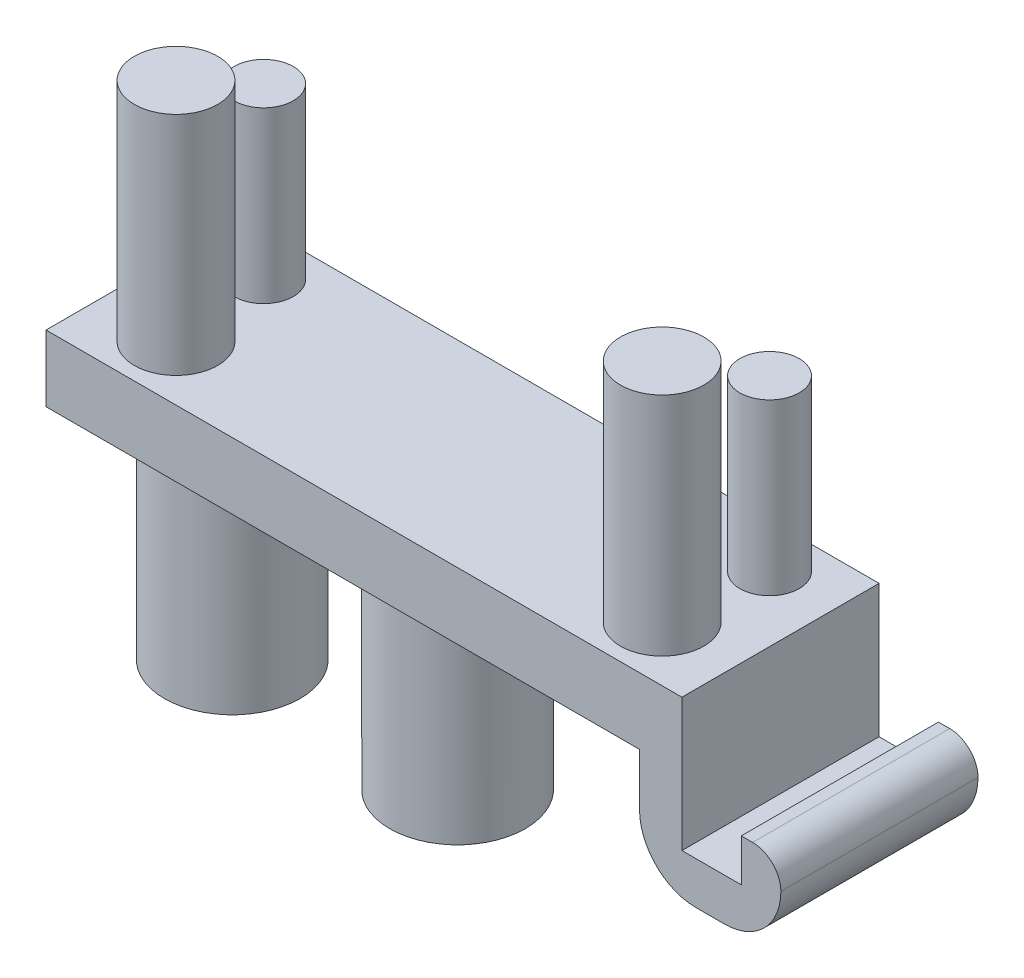
ISO-10303-21;
HEADER;
FILE_DESCRIPTION(('STEP AP214'),'2;1');
FILE_NAME('part.step','',(''),(''),'','','');
FILE_SCHEMA(('AUTOMOTIVE_DESIGN { 1 0 10303 214 1 1 1 1 }'));
ENDSEC;
DATA;
#1=APPLICATION_CONTEXT('core data for automotive mechanical design processes');
#2=APPLICATION_PROTOCOL_DEFINITION('international standard','automotive_design',2000,#1);
#3=PRODUCT_CONTEXT('',#1,'mechanical');
#4=PRODUCT('Part','Part','',(#3));
#5=PRODUCT_RELATED_PRODUCT_CATEGORY('part','',(#4));
#6=PRODUCT_DEFINITION_FORMATION('','',#4);
#7=PRODUCT_DEFINITION_CONTEXT('part definition',#1,'design');
#8=PRODUCT_DEFINITION('design','',#6,#7);
#9=PRODUCT_DEFINITION_SHAPE('','',#8);
#10=(LENGTH_UNIT() NAMED_UNIT(*) SI_UNIT(.MILLI.,.METRE.));
#11=(NAMED_UNIT(*) PLANE_ANGLE_UNIT() SI_UNIT($,.RADIAN.));
#12=(NAMED_UNIT(*) SI_UNIT($,.STERADIAN.) SOLID_ANGLE_UNIT());
#13=UNCERTAINTY_MEASURE_WITH_UNIT(LENGTH_MEASURE(1.E-05),#10,'distance_accuracy_value','');
#14=(GEOMETRIC_REPRESENTATION_CONTEXT(3) GLOBAL_UNCERTAINTY_ASSIGNED_CONTEXT((#13)) GLOBAL_UNIT_ASSIGNED_CONTEXT((#10,
#11,#12)) REPRESENTATION_CONTEXT('',''));
#15=CARTESIAN_POINT('',(0.,0.,0.));
#16=DIRECTION('',(0.,0.,1.));
#17=DIRECTION('',(1.,0.,0.));
#18=AXIS2_PLACEMENT_3D('',#15,#16,#17);
#19=CARTESIAN_POINT('',(-2.96505466974173,-1.85,0.));
#20=DIRECTION('',(0.,0.,-1.));
#21=DIRECTION('',(-1.,0.,0.));
#22=AXIS2_PLACEMENT_3D('',#19,#20,#21);
#23=CYLINDRICAL_SURFACE('',#22,1.);
#24=DIRECTION('',(0.,0.,1.));
#25=VECTOR('',#24,1.);
#26=CARTESIAN_POINT('',(-1.96505466974173,-1.85,0.));
#27=LINE('',#26,#25);
#28=CARTESIAN_POINT('',(-1.96505466974173,-1.85,12.4079553392009));
#29=VERTEX_POINT('',#28);
#30=CARTESIAN_POINT('',(-1.96505466974173,-1.85,5.43295533920093));
#31=VERTEX_POINT('',#30);
#32=EDGE_CURVE('E228',#29,#31,#27,.F.);
#33=ORIENTED_EDGE('',*,*,#32,.T.);
#34=CARTESIAN_POINT('',(-2.96505466974173,-1.85,5.43295533920094));
#35=DIRECTION('',(0.,0.,1.));
#36=DIRECTION('',(1.,0.,0.));
#37=AXIS2_PLACEMENT_3D('',#34,#35,#36);
#38=CIRCLE('',#37,1.);
#39=CARTESIAN_POINT('',(-2.96505466974173,-0.85,5.43295533920093));
#40=VERTEX_POINT('',#39);
#41=EDGE_CURVE('E42',#40,#31,#38,.F.);
#42=ORIENTED_EDGE('',*,*,#41,.F.);
#43=DIRECTION('',(0.,0.,1.));
#44=VECTOR('',#43,1.);
#45=CARTESIAN_POINT('',(-2.96505466974173,-0.849999999999999,0.));
#46=LINE('',#45,#44);
#47=CARTESIAN_POINT('',(-2.96505466974173,-0.850000000000001,12.4079553392009));
#48=VERTEX_POINT('',#47);
#49=EDGE_CURVE('E234',#48,#40,#46,.F.);
#50=ORIENTED_EDGE('',*,*,#49,.F.);
#51=CARTESIAN_POINT('',(-2.96505466974173,-1.85,12.4079553392009));
#52=DIRECTION('',(0.,0.,-1.));
#53=DIRECTION('',(-1.,0.,0.));
#54=AXIS2_PLACEMENT_3D('',#51,#52,#53);
#55=CIRCLE('',#54,1.);
#56=EDGE_CURVE('E11',#29,#48,#55,.F.);
#57=ORIENTED_EDGE('',*,*,#56,.F.);
#58=EDGE_LOOP('',(#33,#42,#50,#57));
#59=FACE_BOUND('',#58,.T.);
#60=ADVANCED_FACE('F35',(#59),#23,.T.);
#61=CARTESIAN_POINT('',(-3.96505466974173,-1.85,0.));
#62=DIRECTION('',(0.,0.,1.));
#63=DIRECTION('',(1.,0.,0.));
#64=AXIS2_PLACEMENT_3D('',#61,#62,#63);
#65=CYLINDRICAL_SURFACE('',#64,2.);
#66=DIRECTION('',(0.,0.,1.));
#67=VECTOR('',#66,1.);
#68=CARTESIAN_POINT('',(-3.96505466974173,-3.85,0.));
#69=LINE('',#68,#67);
#70=CARTESIAN_POINT('',(-3.96505466974173,-3.85,5.43295533920094));
#71=VERTEX_POINT('',#70);
#72=CARTESIAN_POINT('',(-3.96505466974173,-3.85,12.4079553392009));
#73=VERTEX_POINT('',#72);
#74=EDGE_CURVE('E225',#71,#73,#69,.T.);
#75=ORIENTED_EDGE('',*,*,#74,.F.);
#76=CARTESIAN_POINT('',(-3.96505466974173,-1.85,5.43295533920094));
#77=DIRECTION('',(0.,0.,1.));
#78=DIRECTION('',(1.,0.,0.));
#79=AXIS2_PLACEMENT_3D('',#76,#77,#78);
#80=CIRCLE('',#79,2.);
#81=EDGE_CURVE('E230',#31,#71,#80,.F.);
#82=ORIENTED_EDGE('',*,*,#81,.F.);
#83=ORIENTED_EDGE('',*,*,#32,.F.);
#84=CARTESIAN_POINT('',(-3.96505466974173,-1.85,12.4079553392009));
#85=DIRECTION('',(0.,0.,-1.));
#86=DIRECTION('',(-1.,0.,0.));
#87=AXIS2_PLACEMENT_3D('',#84,#85,#86);
#88=CIRCLE('',#87,2.);
#89=EDGE_CURVE('E232',#73,#29,#88,.F.);
#90=ORIENTED_EDGE('',*,*,#89,.F.);
#91=EDGE_LOOP('',(#75,#82,#83,#90));
#92=FACE_BOUND('',#91,.T.);
#93=ADVANCED_FACE('F243',(#92),#65,.T.);
#94=CARTESIAN_POINT('',(-4.96505466974173,-1.85,5.43295533920094));
#95=DIRECTION('',(0.,0.,-1.));
#96=DIRECTION('',(-1.,0.,0.));
#97=AXIS2_PLACEMENT_3D('',#94,#95,#96);
#98=CYLINDRICAL_SURFACE('',#97,2.);
#99=DIRECTION('',(0.,0.,1.));
#100=VECTOR('',#99,1.);
#101=CARTESIAN_POINT('',(-6.96505466974173,-1.85,5.43295533920094));
#102=LINE('',#101,#100);
#103=CARTESIAN_POINT('',(-6.96505466974173,-1.85,5.43295533920094));
#104=VERTEX_POINT('',#103);
#105=CARTESIAN_POINT('',(-6.96505466974173,-1.85,12.4079553392009));
#106=VERTEX_POINT('',#105);
#107=EDGE_CURVE('E214',#104,#106,#102,.T.);
#108=ORIENTED_EDGE('',*,*,#107,.F.);
#109=CARTESIAN_POINT('',(-4.96505466974173,-1.85,5.43295533920094));
#110=DIRECTION('',(0.,0.,1.));
#111=DIRECTION('',(1.,0.,0.));
#112=AXIS2_PLACEMENT_3D('',#109,#110,#111);
#113=CIRCLE('',#112,2.);
#114=CARTESIAN_POINT('',(-4.96505466974173,-3.85,5.43295533920094));
#115=VERTEX_POINT('',#114);
#116=EDGE_CURVE('E220',#115,#104,#113,.F.);
#117=ORIENTED_EDGE('',*,*,#116,.F.);
#118=DIRECTION('',(0.,0.,1.));
#119=VECTOR('',#118,1.);
#120=CARTESIAN_POINT('',(-4.96505466974173,-3.85,5.43295533920094));
#121=LINE('',#120,#119);
#122=CARTESIAN_POINT('',(-4.96505466974173,-3.85,12.4079553392009));
#123=VERTEX_POINT('',#122);
#124=EDGE_CURVE('E217',#123,#115,#121,.F.);
#125=ORIENTED_EDGE('',*,*,#124,.F.);
#126=CARTESIAN_POINT('',(-4.96505466974173,-1.85,12.4079553392009));
#127=DIRECTION('',(0.,0.,-1.));
#128=DIRECTION('',(-1.,0.,0.));
#129=AXIS2_PLACEMENT_3D('',#126,#127,#128);
#130=CIRCLE('',#129,2.);
#131=EDGE_CURVE('E222',#106,#123,#130,.F.);
#132=ORIENTED_EDGE('',*,*,#131,.F.);
#133=EDGE_LOOP('',(#108,#117,#125,#132));
#134=FACE_BOUND('',#133,.T.);
#135=ADVANCED_FACE('F253',(#134),#98,.T.);
#136=CARTESIAN_POINT('',(-5.46505466974173,2.35,5.43295533920094));
#137=DIRECTION('',(-1.,0.,0.));
#138=DIRECTION('',(0.,0.,1.));
#139=AXIS2_PLACEMENT_3D('',#136,#137,#138);
#140=PLANE('',#139);
#141=DIRECTION('',(0.,-1.,0.));
#142=VECTOR('',#141,1.);
#143=CARTESIAN_POINT('',(-5.46505466974173,2.35,12.4079553392009));
#144=LINE('',#143,#142);
#145=CARTESIAN_POINT('',(-5.46505466974173,2.35,12.4079553392009));
#146=VERTEX_POINT('',#145);
#147=CARTESIAN_POINT('',(-5.46505466974173,-2.35,12.4079553392009));
#148=VERTEX_POINT('',#147);
#149=EDGE_CURVE('E121',#146,#148,#144,.T.);
#150=ORIENTED_EDGE('',*,*,#149,.T.);
#151=DIRECTION('',(0.,0.,1.));
#152=VECTOR('',#151,1.);
#153=CARTESIAN_POINT('',(-5.46505466974173,-2.35,5.43295533920094));
#154=LINE('',#153,#152);
#155=CARTESIAN_POINT('',(-5.46505466974173,-2.35,5.43295533920094));
#156=VERTEX_POINT('',#155);
#157=EDGE_CURVE('E125',#156,#148,#154,.T.);
#158=ORIENTED_EDGE('',*,*,#157,.F.);
#159=DIRECTION('',(0.,-1.,0.));
#160=VECTOR('',#159,1.);
#161=CARTESIAN_POINT('',(-5.46505466974173,2.35,5.43295533920094));
#162=LINE('',#161,#160);
#163=CARTESIAN_POINT('',(-5.46505466974173,2.35,5.43295533920094));
#164=VERTEX_POINT('',#163);
#165=EDGE_CURVE('E130',#164,#156,#162,.T.);
#166=ORIENTED_EDGE('',*,*,#165,.F.);
#167=DIRECTION('',(0.,0.,-1.));
#168=VECTOR('',#167,1.);
#169=CARTESIAN_POINT('',(-5.46505466974173,2.35,5.43295533920094));
#170=LINE('',#169,#168);
#171=EDGE_CURVE('E127',#146,#164,#170,.T.);
#172=ORIENTED_EDGE('',*,*,#171,.F.);
#173=EDGE_LOOP('',(#150,#158,#166,#172));
#174=FACE_BOUND('',#173,.T.);
#175=ADVANCED_FACE('F123',(#174),#140,.F.);
#176=CARTESIAN_POINT('',(0.,0.,0.));
#177=DIRECTION('',(0.,1.,0.));
#178=DIRECTION('',(0.,0.,1.));
#179=AXIS2_PLACEMENT_3D('',#176,#177,#178);
#180=PLANE('',#179);
#181=CARTESIAN_POINT('',(-24.6850546697417,0.,9.09795533920093));
#182=DIRECTION('',(0.,1.,0.));
#183=DIRECTION('',(0.,0.,1.));
#184=AXIS2_PLACEMENT_3D('',#181,#182,#183);
#185=CIRCLE('',#184,2.4);
#186=CARTESIAN_POINT('',(-24.6850546697417,0.,11.4979553392009));
#187=VERTEX_POINT('',#186);
#188=EDGE_CURVE('E211',#187,#187,#185,.F.);
#189=ORIENTED_EDGE('',*,*,#188,.F.);
#190=EDGE_LOOP('',(#189));
#191=FACE_BOUND('',#190,.T.);
#192=CARTESIAN_POINT('',(-16.7150546697417,0.,9.09795533920093));
#193=DIRECTION('',(0.,1.,0.));
#194=DIRECTION('',(0.,0.,1.));
#195=AXIS2_PLACEMENT_3D('',#192,#193,#194);
#196=CIRCLE('',#195,2.4);
#197=CARTESIAN_POINT('',(-16.7150546697417,0.,11.4979553392009));
#198=VERTEX_POINT('',#197);
#199=EDGE_CURVE('E208',#198,#198,#196,.F.);
#200=ORIENTED_EDGE('',*,*,#199,.F.);
#201=EDGE_LOOP('',(#200));
#202=FACE_BOUND('',#201,.T.);
#203=DIRECTION('',(0.,0.,-1.));
#204=VECTOR('',#203,1.);
#205=CARTESIAN_POINT('',(-6.96505466974173,0.,5.43295533920094));
#206=LINE('',#205,#204);
#207=CARTESIAN_POINT('',(-6.96505466974174,0.,12.4079553392009));
#208=VERTEX_POINT('',#207);
#209=CARTESIAN_POINT('',(-6.96505466974173,0.,5.43295533920094));
#210=VERTEX_POINT('',#209);
#211=EDGE_CURVE('E162',#208,#210,#206,.T.);
#212=ORIENTED_EDGE('',*,*,#211,.F.);
#213=DIRECTION('',(1.,0.,0.));
#214=VECTOR('',#213,1.);
#215=CARTESIAN_POINT('',(-27.9650546697417,0.,12.4079553392009));
#216=LINE('',#215,#214);
#217=CARTESIAN_POINT('',(-27.9650546697417,0.,12.4079553392009));
#218=VERTEX_POINT('',#217);
#219=EDGE_CURVE('E199',#218,#208,#216,.T.);
#220=ORIENTED_EDGE('',*,*,#219,.F.);
#221=DIRECTION('',(0.,0.,1.));
#222=VECTOR('',#221,1.);
#223=CARTESIAN_POINT('',(-27.9650546697417,0.,5.43295533920094));
#224=LINE('',#223,#222);
#225=CARTESIAN_POINT('',(-27.9650546697417,0.,5.43295533920094));
#226=VERTEX_POINT('',#225);
#227=EDGE_CURVE('E184',#226,#218,#224,.T.);
#228=ORIENTED_EDGE('',*,*,#227,.F.);
#229=DIRECTION('',(-1.,0.,0.));
#230=VECTOR('',#229,1.);
#231=CARTESIAN_POINT('',(-27.9650546697417,0.,5.43295533920094));
#232=LINE('',#231,#230);
#233=EDGE_CURVE('E191',#210,#226,#232,.T.);
#234=ORIENTED_EDGE('',*,*,#233,.F.);
#235=EDGE_LOOP('',(#212,#220,#228,#234));
#236=FACE_BOUND('',#235,.T.);
#237=ADVANCED_FACE('F259',(#191,#202,#236),#180,.F.);
#238=CARTESIAN_POINT('',(-27.9650546697417,2.35,5.43295533920094));
#239=DIRECTION('',(1.,0.,0.));
#240=DIRECTION('',(0.,0.,-1.));
#241=AXIS2_PLACEMENT_3D('',#238,#239,#240);
#242=PLANE('',#241);
#243=ORIENTED_EDGE('',*,*,#227,.T.);
#244=DIRECTION('',(0.,-1.,0.));
#245=VECTOR('',#244,1.);
#246=CARTESIAN_POINT('',(-27.9650546697417,2.35,12.4079553392009));
#247=LINE('',#246,#245);
#248=CARTESIAN_POINT('',(-27.9650546697417,2.35,12.4079553392009));
#249=VERTEX_POINT('',#248);
#250=EDGE_CURVE('E129',#249,#218,#247,.T.);
#251=ORIENTED_EDGE('',*,*,#250,.F.);
#252=DIRECTION('',(0.,0.,1.));
#253=VECTOR('',#252,1.);
#254=CARTESIAN_POINT('',(-27.9650546697417,2.35,5.43295533920094));
#255=LINE('',#254,#253);
#256=CARTESIAN_POINT('',(-27.9650546697417,2.35,5.43295533920094));
#257=VERTEX_POINT('',#256);
#258=EDGE_CURVE('E187',#257,#249,#255,.T.);
#259=ORIENTED_EDGE('',*,*,#258,.F.);
#260=DIRECTION('',(0.,-1.,0.));
#261=VECTOR('',#260,1.);
#262=CARTESIAN_POINT('',(-27.9650546697417,2.35,5.43295533920094));
#263=LINE('',#262,#261);
#264=EDGE_CURVE('E196',#257,#226,#263,.T.);
#265=ORIENTED_EDGE('',*,*,#264,.T.);
#266=EDGE_LOOP('',(#243,#251,#259,#265));
#267=FACE_BOUND('',#266,.T.);
#268=ADVANCED_FACE('F264',(#267),#242,.F.);
#269=CARTESIAN_POINT('',(-27.9650546697417,2.35,12.4079553392009));
#270=DIRECTION('',(0.,0.,-1.));
#271=DIRECTION('',(-1.,0.,0.));
#272=AXIS2_PLACEMENT_3D('',#269,#270,#271);
#273=PLANE('',#272);
#274=ORIENTED_EDGE('',*,*,#89,.T.);
#275=ORIENTED_EDGE('',*,*,#56,.T.);
#276=DIRECTION('',(-1.,0.,0.));
#277=VECTOR('',#276,1.);
#278=CARTESIAN_POINT('',(-1.96505466974173,-0.850000000000001,12.4079553392009));
#279=LINE('',#278,#277);
#280=CARTESIAN_POINT('',(-3.36505466974173,-0.850000000000001,12.4079553392009));
#281=VERTEX_POINT('',#280);
#282=EDGE_CURVE('E157',#48,#281,#279,.T.);
#283=ORIENTED_EDGE('',*,*,#282,.T.);
#284=DIRECTION('',(0.,1.,0.));
#285=VECTOR('',#284,1.);
#286=CARTESIAN_POINT('',(-3.36505466974173,-2.35,12.4079553392009));
#287=LINE('',#286,#285);
#288=CARTESIAN_POINT('',(-3.36505466974173,-2.35,12.4079553392009));
#289=VERTEX_POINT('',#288);
#290=EDGE_CURVE('E144',#289,#281,#287,.T.);
#291=ORIENTED_EDGE('',*,*,#290,.F.);
#292=DIRECTION('',(1.,0.,0.));
#293=VECTOR('',#292,1.);
#294=CARTESIAN_POINT('',(-5.46505466974173,-2.35,12.4079553392009));
#295=LINE('',#294,#293);
#296=EDGE_CURVE('E136',#148,#289,#295,.T.);
#297=ORIENTED_EDGE('',*,*,#296,.F.);
#298=ORIENTED_EDGE('',*,*,#149,.F.);
#299=DIRECTION('',(1.,0.,0.));
#300=VECTOR('',#299,1.);
#301=CARTESIAN_POINT('',(-27.9650546697417,2.35,12.4079553392009));
#302=LINE('',#301,#300);
#303=EDGE_CURVE('E190',#249,#146,#302,.T.);
#304=ORIENTED_EDGE('',*,*,#303,.F.);
#305=ORIENTED_EDGE('',*,*,#250,.T.);
#306=ORIENTED_EDGE('',*,*,#219,.T.);
#307=DIRECTION('',(0.,1.,0.));
#308=VECTOR('',#307,1.);
#309=CARTESIAN_POINT('',(-6.96505466974173,-3.85,12.4079553392009));
#310=LINE('',#309,#308);
#311=EDGE_CURVE('E172',#106,#208,#310,.T.);
#312=ORIENTED_EDGE('',*,*,#311,.F.);
#313=ORIENTED_EDGE('',*,*,#131,.T.);
#314=DIRECTION('',(-1.,0.,0.));
#315=VECTOR('',#314,1.);
#316=CARTESIAN_POINT('',(-5.46505466974173,-3.85,12.4079553392009));
#317=LINE('',#316,#315);
#318=EDGE_CURVE('E163',#73,#123,#317,.T.);
#319=ORIENTED_EDGE('',*,*,#318,.F.);
#320=EDGE_LOOP('',(#274,#275,#283,#291,#297,#298,#304,#305,#306,#312,#313,#319));
#321=FACE_BOUND('',#320,.T.);
#322=ADVANCED_FACE('F142',(#321),#273,.F.);
#323=CARTESIAN_POINT('',(-27.9650546697417,2.35,5.43295533920094));
#324=DIRECTION('',(0.,0.,1.));
#325=DIRECTION('',(1.,0.,0.));
#326=AXIS2_PLACEMENT_3D('',#323,#324,#325);
#327=PLANE('',#326);
#328=DIRECTION('',(-1.,0.,0.));
#329=VECTOR('',#328,1.);
#330=CARTESIAN_POINT('',(-1.96505466974173,-0.85,5.43295533920093));
#331=LINE('',#330,#329);
#332=CARTESIAN_POINT('',(-3.36505466974173,-0.85,5.43295533920094));
#333=VERTEX_POINT('',#332);
#334=EDGE_CURVE('E160',#40,#333,#331,.T.);
#335=ORIENTED_EDGE('',*,*,#334,.F.);
#336=ORIENTED_EDGE('',*,*,#41,.T.);
#337=ORIENTED_EDGE('',*,*,#81,.T.);
#338=DIRECTION('',(1.,0.,0.));
#339=VECTOR('',#338,1.);
#340=CARTESIAN_POINT('',(-5.46505466974173,-3.85,5.43295533920094));
#341=LINE('',#340,#339);
#342=EDGE_CURVE('E165',#115,#71,#341,.T.);
#343=ORIENTED_EDGE('',*,*,#342,.F.);
#344=ORIENTED_EDGE('',*,*,#116,.T.);
#345=DIRECTION('',(0.,1.,0.));
#346=VECTOR('',#345,1.);
#347=CARTESIAN_POINT('',(-6.96505466974173,-3.85,5.43295533920094));
#348=LINE('',#347,#346);
#349=EDGE_CURVE('E168',#104,#210,#348,.T.);
#350=ORIENTED_EDGE('',*,*,#349,.T.);
#351=ORIENTED_EDGE('',*,*,#233,.T.);
#352=ORIENTED_EDGE('',*,*,#264,.F.);
#353=DIRECTION('',(-1.,0.,0.));
#354=VECTOR('',#353,1.);
#355=CARTESIAN_POINT('',(-27.9650546697417,2.35,5.43295533920094));
#356=LINE('',#355,#354);
#357=EDGE_CURVE('E194',#164,#257,#356,.T.);
#358=ORIENTED_EDGE('',*,*,#357,.F.);
#359=ORIENTED_EDGE('',*,*,#165,.T.);
#360=DIRECTION('',(-1.,0.,0.));
#361=VECTOR('',#360,1.);
#362=CARTESIAN_POINT('',(-5.46505466974173,-2.35,5.43295533920094));
#363=LINE('',#362,#361);
#364=CARTESIAN_POINT('',(-3.36505466974173,-2.35,5.43295533920094));
#365=VERTEX_POINT('',#364);
#366=EDGE_CURVE('E139',#365,#156,#363,.T.);
#367=ORIENTED_EDGE('',*,*,#366,.F.);
#368=DIRECTION('',(0.,1.,0.));
#369=VECTOR('',#368,1.);
#370=CARTESIAN_POINT('',(-3.36505466974173,-2.35,5.43295533920094));
#371=LINE('',#370,#369);
#372=EDGE_CURVE('E154',#365,#333,#371,.T.);
#373=ORIENTED_EDGE('',*,*,#372,.T.);
#374=EDGE_LOOP('',(#335,#336,#337,#343,#344,#350,#351,#352,#358,#359,#367,#373));
#375=FACE_BOUND('',#374,.T.);
#376=ADVANCED_FACE('F238',(#375),#327,.F.);
#377=CARTESIAN_POINT('',(0.,2.35,0.));
#378=DIRECTION('',(0.,1.,0.));
#379=DIRECTION('',(0.,0.,1.));
#380=AXIS2_PLACEMENT_3D('',#377,#378,#379);
#381=PLANE('',#380);
#382=CARTESIAN_POINT('',(-25.6650546697417,2.35,7.00795533920093));
#383=DIRECTION('',(0.,1.,0.));
#384=DIRECTION('',(0.,0.,1.));
#385=AXIS2_PLACEMENT_3D('',#382,#383,#384);
#386=CIRCLE('',#385,1.05);
#387=CARTESIAN_POINT('',(-25.6650546697417,2.35,8.05795533920093));
#388=VERTEX_POINT('',#387);
#389=EDGE_CURVE('E496',#388,#388,#386,.T.);
#390=ORIENTED_EDGE('',*,*,#389,.F.);
#391=EDGE_LOOP('',(#390));
#392=FACE_BOUND('',#391,.T.);
#393=CARTESIAN_POINT('',(-7.76505466974173,2.35,7.00795533920093));
#394=DIRECTION('',(0.,1.,0.));
#395=DIRECTION('',(0.,0.,1.));
#396=AXIS2_PLACEMENT_3D('',#393,#394,#395);
#397=CIRCLE('',#396,1.05);
#398=CARTESIAN_POINT('',(-7.76505466974173,2.35,8.05795533920094));
#399=VERTEX_POINT('',#398);
#400=EDGE_CURVE('E502',#399,#399,#397,.T.);
#401=ORIENTED_EDGE('',*,*,#400,.F.);
#402=EDGE_LOOP('',(#401));
#403=FACE_BOUND('',#402,.T.);
#404=CARTESIAN_POINT('',(-8.11505466974173,2.35,10.4579553392009));
#405=DIRECTION('',(0.,1.,0.));
#406=DIRECTION('',(0.,0.,1.));
#407=AXIS2_PLACEMENT_3D('',#404,#405,#406);
#408=CIRCLE('',#407,1.475);
#409=CARTESIAN_POINT('',(-8.11505466974173,2.35,11.9329553392009));
#410=VERTEX_POINT('',#409);
#411=EDGE_CURVE('E174',#410,#410,#408,.T.);
#412=ORIENTED_EDGE('',*,*,#411,.F.);
#413=EDGE_LOOP('',(#412));
#414=FACE_BOUND('',#413,.T.);
#415=CARTESIAN_POINT('',(-25.3150546697417,2.35,10.4579553392009));
#416=DIRECTION('',(0.,1.,0.));
#417=DIRECTION('',(0.,0.,1.));
#418=AXIS2_PLACEMENT_3D('',#415,#416,#417);
#419=CIRCLE('',#418,1.475);
#420=CARTESIAN_POINT('',(-25.3150546697417,2.35,11.9329553392009));
#421=VERTEX_POINT('',#420);
#422=EDGE_CURVE('E178',#421,#421,#419,.T.);
#423=ORIENTED_EDGE('',*,*,#422,.F.);
#424=EDGE_LOOP('',(#423));
#425=FACE_BOUND('',#424,.T.);
#426=ORIENTED_EDGE('',*,*,#258,.T.);
#427=ORIENTED_EDGE('',*,*,#303,.T.);
#428=ORIENTED_EDGE('',*,*,#171,.T.);
#429=ORIENTED_EDGE('',*,*,#357,.T.);
#430=EDGE_LOOP('',(#426,#427,#428,#429));
#431=FACE_BOUND('',#430,.T.);
#432=ADVANCED_FACE('F268',(#392,#403,#414,#425,#431),#381,.T.);
#433=CARTESIAN_POINT('',(-25.3150546697417,10.35,10.4579553392009));
#434=DIRECTION('',(0.,-1.,0.));
#435=DIRECTION('',(0.,0.,-1.));
#436=AXIS2_PLACEMENT_3D('',#433,#434,#435);
#437=CYLINDRICAL_SURFACE('',#436,1.475);
#438=CARTESIAN_POINT('',(-25.3150546697417,10.35,10.4579553392009));
#439=DIRECTION('',(0.,1.,0.));
#440=DIRECTION('',(0.,0.,1.));
#441=AXIS2_PLACEMENT_3D('',#438,#439,#440);
#442=CIRCLE('',#441,1.475);
#443=CARTESIAN_POINT('',(-25.3150546697417,10.35,11.9329553392009));
#444=VERTEX_POINT('',#443);
#445=EDGE_CURVE('E181',#444,#444,#442,.T.);
#446=ORIENTED_EDGE('',*,*,#445,.F.);
#447=EDGE_LOOP('',(#446));
#448=FACE_BOUND('',#447,.T.);
#449=ORIENTED_EDGE('',*,*,#422,.T.);
#450=EDGE_LOOP('',(#449));
#451=FACE_BOUND('',#450,.T.);
#452=ADVANCED_FACE('F270',(#448,#451),#437,.T.);
#453=CARTESIAN_POINT('',(-25.3150546697417,10.35,10.4579553392009));
#454=DIRECTION('',(0.,1.,0.));
#455=DIRECTION('',(0.,0.,1.));
#456=AXIS2_PLACEMENT_3D('',#453,#454,#455);
#457=PLANE('',#456);
#458=ORIENTED_EDGE('',*,*,#445,.T.);
#459=EDGE_LOOP('',(#458));
#460=FACE_BOUND('',#459,.T.);
#461=ADVANCED_FACE('F278',(#460),#457,.T.);
#462=CARTESIAN_POINT('',(-8.11505466974173,10.35,10.4579553392009));
#463=DIRECTION('',(0.,-1.,0.));
#464=DIRECTION('',(0.,0.,-1.));
#465=AXIS2_PLACEMENT_3D('',#462,#463,#464);
#466=CYLINDRICAL_SURFACE('',#465,1.475);
#467=CARTESIAN_POINT('',(-8.11505466974173,10.35,10.4579553392009));
#468=DIRECTION('',(0.,1.,0.));
#469=DIRECTION('',(0.,0.,1.));
#470=AXIS2_PLACEMENT_3D('',#467,#468,#469);
#471=CIRCLE('',#470,1.475);
#472=CARTESIAN_POINT('',(-8.11505466974173,10.35,11.9329553392009));
#473=VERTEX_POINT('',#472);
#474=EDGE_CURVE('E175',#473,#473,#471,.T.);
#475=ORIENTED_EDGE('',*,*,#474,.F.);
#476=EDGE_LOOP('',(#475));
#477=FACE_BOUND('',#476,.T.);
#478=ORIENTED_EDGE('',*,*,#411,.T.);
#479=EDGE_LOOP('',(#478));
#480=FACE_BOUND('',#479,.T.);
#481=ADVANCED_FACE('F357',(#477,#480),#466,.T.);
#482=CARTESIAN_POINT('',(-8.11505466974173,10.35,10.4579553392009));
#483=DIRECTION('',(0.,1.,0.));
#484=DIRECTION('',(0.,0.,1.));
#485=AXIS2_PLACEMENT_3D('',#482,#483,#484);
#486=PLANE('',#485);
#487=ORIENTED_EDGE('',*,*,#474,.T.);
#488=EDGE_LOOP('',(#487));
#489=FACE_BOUND('',#488,.T.);
#490=ADVANCED_FACE('F354',(#489),#486,.T.);
#491=CARTESIAN_POINT('',(-6.96505466974173,-3.85,5.43295533920094));
#492=DIRECTION('',(1.,0.,0.));
#493=DIRECTION('',(0.,0.,-1.));
#494=AXIS2_PLACEMENT_3D('',#491,#492,#493);
#495=PLANE('',#494);
#496=ORIENTED_EDGE('',*,*,#349,.F.);
#497=ORIENTED_EDGE('',*,*,#107,.T.);
#498=ORIENTED_EDGE('',*,*,#311,.T.);
#499=ORIENTED_EDGE('',*,*,#211,.T.);
#500=EDGE_LOOP('',(#496,#497,#498,#499));
#501=FACE_BOUND('',#500,.T.);
#502=ADVANCED_FACE('F256',(#501),#495,.F.);
#503=CARTESIAN_POINT('',(0.,-3.85,0.));
#504=DIRECTION('',(0.,-1.,0.));
#505=DIRECTION('',(0.,0.,-1.));
#506=AXIS2_PLACEMENT_3D('',#503,#504,#505);
#507=PLANE('',#506);
#508=ORIENTED_EDGE('',*,*,#342,.T.);
#509=ORIENTED_EDGE('',*,*,#74,.T.);
#510=ORIENTED_EDGE('',*,*,#318,.T.);
#511=ORIENTED_EDGE('',*,*,#124,.T.);
#512=EDGE_LOOP('',(#508,#509,#510,#511));
#513=FACE_BOUND('',#512,.T.);
#514=ADVANCED_FACE('F247',(#513),#507,.T.);
#515=CARTESIAN_POINT('',(-1.96505466974173,-0.85,5.43295533920093));
#516=DIRECTION('',(0.,-1.,0.));
#517=DIRECTION('',(0.,0.,-1.));
#518=AXIS2_PLACEMENT_3D('',#515,#516,#517);
#519=PLANE('',#518);
#520=ORIENTED_EDGE('',*,*,#282,.F.);
#521=ORIENTED_EDGE('',*,*,#49,.T.);
#522=ORIENTED_EDGE('',*,*,#334,.T.);
#523=DIRECTION('',(0.,0.,-1.));
#524=VECTOR('',#523,1.);
#525=CARTESIAN_POINT('',(-3.36505466974173,-0.85,5.43295533920094));
#526=LINE('',#525,#524);
#527=EDGE_CURVE('E140',#281,#333,#526,.T.);
#528=ORIENTED_EDGE('',*,*,#527,.F.);
#529=EDGE_LOOP('',(#520,#521,#522,#528));
#530=FACE_BOUND('',#529,.T.);
#531=ADVANCED_FACE('F345',(#530),#519,.F.);
#532=CARTESIAN_POINT('',(-3.36505466974173,-2.35,5.43295533920094));
#533=DIRECTION('',(1.,0.,0.));
#534=DIRECTION('',(0.,0.,-1.));
#535=AXIS2_PLACEMENT_3D('',#532,#533,#534);
#536=PLANE('',#535);
#537=ORIENTED_EDGE('',*,*,#527,.T.);
#538=ORIENTED_EDGE('',*,*,#372,.F.);
#539=DIRECTION('',(0.,0.,-1.));
#540=VECTOR('',#539,1.);
#541=CARTESIAN_POINT('',(-3.36505466974173,-2.35,5.43295533920094));
#542=LINE('',#541,#540);
#543=EDGE_CURVE('E145',#289,#365,#542,.T.);
#544=ORIENTED_EDGE('',*,*,#543,.F.);
#545=ORIENTED_EDGE('',*,*,#290,.T.);
#546=EDGE_LOOP('',(#537,#538,#544,#545));
#547=FACE_BOUND('',#546,.T.);
#548=ADVANCED_FACE('F342',(#547),#536,.F.);
#549=CARTESIAN_POINT('',(0.,-2.35,0.));
#550=DIRECTION('',(0.,1.,0.));
#551=DIRECTION('',(0.,0.,1.));
#552=AXIS2_PLACEMENT_3D('',#549,#550,#551);
#553=PLANE('',#552);
#554=ORIENTED_EDGE('',*,*,#157,.T.);
#555=ORIENTED_EDGE('',*,*,#296,.T.);
#556=ORIENTED_EDGE('',*,*,#543,.T.);
#557=ORIENTED_EDGE('',*,*,#366,.T.);
#558=EDGE_LOOP('',(#554,#555,#556,#557));
#559=FACE_BOUND('',#558,.T.);
#560=ADVANCED_FACE('F134',(#559),#553,.T.);
#561=CARTESIAN_POINT('',(-7.76505466974173,8.35,7.00795533920093));
#562=DIRECTION('',(0.,-1.,0.));
#563=DIRECTION('',(0.,0.,-1.));
#564=AXIS2_PLACEMENT_3D('',#561,#562,#563);
#565=CYLINDRICAL_SURFACE('',#564,1.05);
#566=CARTESIAN_POINT('',(-7.76505466974173,8.35,7.00795533920093));
#567=DIRECTION('',(0.,1.,0.));
#568=DIRECTION('',(0.,0.,1.));
#569=AXIS2_PLACEMENT_3D('',#566,#567,#568);
#570=CIRCLE('',#569,1.05);
#571=CARTESIAN_POINT('',(-7.76505466974173,8.35,8.05795533920094));
#572=VERTEX_POINT('',#571);
#573=EDGE_CURVE('E153',#572,#572,#570,.T.);
#574=ORIENTED_EDGE('',*,*,#573,.F.);
#575=EDGE_LOOP('',(#574));
#576=FACE_BOUND('',#575,.T.);
#577=ORIENTED_EDGE('',*,*,#400,.T.);
#578=EDGE_LOOP('',(#577));
#579=FACE_BOUND('',#578,.T.);
#580=ADVANCED_FACE('F335',(#576,#579),#565,.T.);
#581=CARTESIAN_POINT('',(-7.76505466974173,8.35,7.00795533920093));
#582=DIRECTION('',(0.,1.,0.));
#583=DIRECTION('',(0.,0.,1.));
#584=AXIS2_PLACEMENT_3D('',#581,#582,#583);
#585=PLANE('',#584);
#586=ORIENTED_EDGE('',*,*,#573,.T.);
#587=EDGE_LOOP('',(#586));
#588=FACE_BOUND('',#587,.T.);
#589=ADVANCED_FACE('F331',(#588),#585,.T.);
#590=CARTESIAN_POINT('',(-25.6650546697417,8.35,7.00795533920093));
#591=DIRECTION('',(0.,-1.,0.));
#592=DIRECTION('',(0.,0.,-1.));
#593=AXIS2_PLACEMENT_3D('',#590,#591,#592);
#594=CYLINDRICAL_SURFACE('',#593,1.05);
#595=CARTESIAN_POINT('',(-25.6650546697417,8.35,7.00795533920093));
#596=DIRECTION('',(0.,1.,0.));
#597=DIRECTION('',(0.,0.,1.));
#598=AXIS2_PLACEMENT_3D('',#595,#596,#597);
#599=CIRCLE('',#598,1.05);
#600=CARTESIAN_POINT('',(-25.6650546697417,8.35,8.05795533920093));
#601=VERTEX_POINT('',#600);
#602=EDGE_CURVE('E499',#601,#601,#599,.T.);
#603=ORIENTED_EDGE('',*,*,#602,.F.);
#604=EDGE_LOOP('',(#603));
#605=FACE_BOUND('',#604,.T.);
#606=ORIENTED_EDGE('',*,*,#389,.T.);
#607=EDGE_LOOP('',(#606));
#608=FACE_BOUND('',#607,.T.);
#609=ADVANCED_FACE('F323',(#605,#608),#594,.T.);
#610=CARTESIAN_POINT('',(-25.6650546697417,8.35,7.00795533920093));
#611=DIRECTION('',(0.,1.,0.));
#612=DIRECTION('',(0.,0.,1.));
#613=AXIS2_PLACEMENT_3D('',#610,#611,#612);
#614=PLANE('',#613);
#615=ORIENTED_EDGE('',*,*,#602,.T.);
#616=EDGE_LOOP('',(#615));
#617=FACE_BOUND('',#616,.T.);
#618=ADVANCED_FACE('F314',(#617),#614,.T.);
#619=CARTESIAN_POINT('',(-16.7150546697417,-7.76,9.09795533920093));
#620=DIRECTION('',(0.,1.,0.));
#621=DIRECTION('',(0.,0.,1.));
#622=AXIS2_PLACEMENT_3D('',#619,#620,#621);
#623=CYLINDRICAL_SURFACE('',#622,2.4);
#624=CARTESIAN_POINT('',(-16.7150546697417,-7.76,9.09795533920093));
#625=DIRECTION('',(0.,-1.,0.));
#626=DIRECTION('',(0.,0.,-1.));
#627=AXIS2_PLACEMENT_3D('',#624,#625,#626);
#628=CIRCLE('',#627,2.4);
#629=CARTESIAN_POINT('',(-16.7150546697417,-7.76,6.69795533920093));
#630=VERTEX_POINT('',#629);
#631=EDGE_CURVE('E493',#630,#630,#628,.T.);
#632=ORIENTED_EDGE('',*,*,#631,.F.);
#633=EDGE_LOOP('',(#632));
#634=FACE_BOUND('',#633,.T.);
#635=ORIENTED_EDGE('',*,*,#199,.T.);
#636=EDGE_LOOP('',(#635));
#637=FACE_BOUND('',#636,.T.);
#638=ADVANCED_FACE('F311',(#634,#637),#623,.T.);
#639=CARTESIAN_POINT('',(-16.7150546697417,-7.76,9.09795533920093));
#640=DIRECTION('',(0.,-1.,0.));
#641=DIRECTION('',(0.,0.,-1.));
#642=AXIS2_PLACEMENT_3D('',#639,#640,#641);
#643=PLANE('',#642);
#644=ORIENTED_EDGE('',*,*,#631,.T.);
#645=EDGE_LOOP('',(#644));
#646=FACE_BOUND('',#645,.T.);
#647=ADVANCED_FACE('F313',(#646),#643,.T.);
#648=CARTESIAN_POINT('',(-24.6850546697417,-7.76,9.09795533920093));
#649=DIRECTION('',(0.,1.,0.));
#650=DIRECTION('',(0.,0.,1.));
#651=AXIS2_PLACEMENT_3D('',#648,#649,#650);
#652=CYLINDRICAL_SURFACE('',#651,2.4);
#653=CARTESIAN_POINT('',(-24.6850546697417,-7.76,9.09795533920093));
#654=DIRECTION('',(0.,-1.,0.));
#655=DIRECTION('',(0.,0.,-1.));
#656=AXIS2_PLACEMENT_3D('',#653,#654,#655);
#657=CIRCLE('',#656,2.4);
#658=CARTESIAN_POINT('',(-24.6850546697417,-7.76,6.69795533920093));
#659=VERTEX_POINT('',#658);
#660=EDGE_CURVE('E492',#659,#659,#657,.T.);
#661=ORIENTED_EDGE('',*,*,#660,.F.);
#662=EDGE_LOOP('',(#661));
#663=FACE_BOUND('',#662,.T.);
#664=ORIENTED_EDGE('',*,*,#188,.T.);
#665=EDGE_LOOP('',(#664));
#666=FACE_BOUND('',#665,.T.);
#667=ADVANCED_FACE('F320',(#663,#666),#652,.T.);
#668=CARTESIAN_POINT('',(-24.6850546697417,-7.76,9.09795533920093));
#669=DIRECTION('',(0.,-1.,0.));
#670=DIRECTION('',(0.,0.,-1.));
#671=AXIS2_PLACEMENT_3D('',#668,#669,#670);
#672=PLANE('',#671);
#673=ORIENTED_EDGE('',*,*,#660,.T.);
#674=EDGE_LOOP('',(#673));
#675=FACE_BOUND('',#674,.T.);
#676=ADVANCED_FACE('F465',(#675),#672,.T.);
#677=CLOSED_SHELL('',(#60,#93,#135,#175,#237,#268,#322,#376,#432,#452,#461,#481,#490,#502,#514,
#531,#548,#560,#580,#589,#609,#618,#638,#647,#667,#676));
#678=MANIFOLD_SOLID_BREP('B2',#677);
#679=ADVANCED_BREP_SHAPE_REPRESENTATION('',(#18,#678),#14);
#680=SHAPE_DEFINITION_REPRESENTATION(#9,#679);
ENDSEC;
END-ISO-10303-21;
